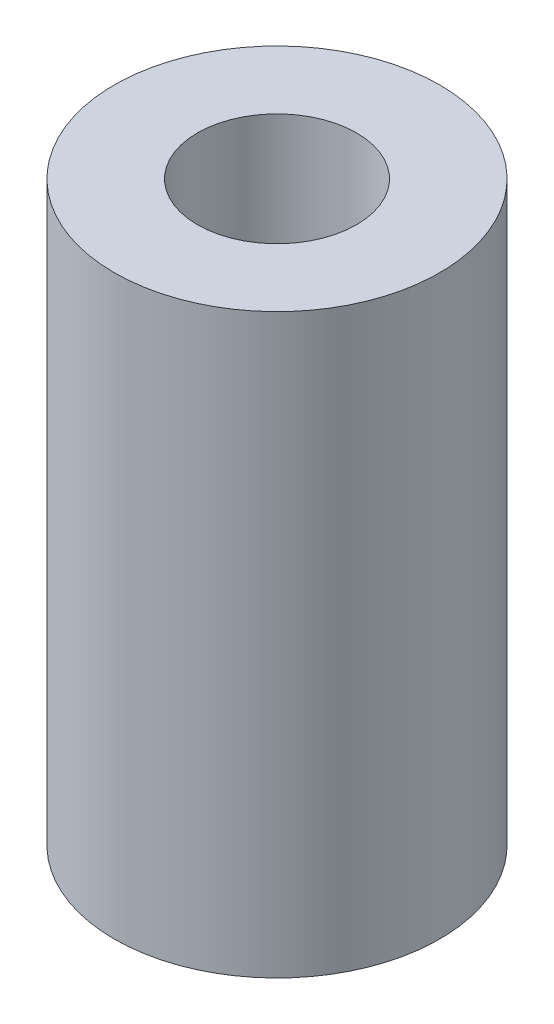
ISO-10303-21;
HEADER;
FILE_DESCRIPTION(('STEP AP214'),'2;1');
FILE_NAME('part.step','',(''),(''),'','','');
FILE_SCHEMA(('AUTOMOTIVE_DESIGN { 1 0 10303 214 1 1 1 1 }'));
ENDSEC;
DATA;
#1=APPLICATION_CONTEXT('core data for automotive mechanical design processes');
#2=APPLICATION_PROTOCOL_DEFINITION('international standard','automotive_design',2000,#1);
#3=PRODUCT_CONTEXT('',#1,'mechanical');
#4=PRODUCT('Part','Part','',(#3));
#5=PRODUCT_RELATED_PRODUCT_CATEGORY('part','',(#4));
#6=PRODUCT_DEFINITION_FORMATION('','',#4);
#7=PRODUCT_DEFINITION_CONTEXT('part definition',#1,'design');
#8=PRODUCT_DEFINITION('design','',#6,#7);
#9=PRODUCT_DEFINITION_SHAPE('','',#8);
#10=(LENGTH_UNIT() NAMED_UNIT(*) SI_UNIT(.MILLI.,.METRE.));
#11=(NAMED_UNIT(*) PLANE_ANGLE_UNIT() SI_UNIT($,.RADIAN.));
#12=(NAMED_UNIT(*) SI_UNIT($,.STERADIAN.) SOLID_ANGLE_UNIT());
#13=UNCERTAINTY_MEASURE_WITH_UNIT(LENGTH_MEASURE(1.E-05),#10,'distance_accuracy_value','');
#14=(GEOMETRIC_REPRESENTATION_CONTEXT(3) GLOBAL_UNCERTAINTY_ASSIGNED_CONTEXT((#13)) GLOBAL_UNIT_ASSIGNED_CONTEXT((#10,
#11,#12)) REPRESENTATION_CONTEXT('',''));
#15=CARTESIAN_POINT('',(0.,0.,0.));
#16=DIRECTION('',(0.,0.,1.));
#17=DIRECTION('',(1.,0.,0.));
#18=AXIS2_PLACEMENT_3D('',#15,#16,#17);
#19=CARTESIAN_POINT('',(0.,115.146666666667,0.));
#20=DIRECTION('',(0.,1.,0.));
#21=DIRECTION('',(0.,0.,1.));
#22=AXIS2_PLACEMENT_3D('',#19,#20,#21);
#23=PLANE('',#22);
#24=CARTESIAN_POINT('',(0.,115.146666666667,0.));
#25=DIRECTION('',(0.,1.,0.));
#26=DIRECTION('',(0.,0.,1.));
#27=AXIS2_PLACEMENT_3D('',#24,#25,#26);
#28=CIRCLE('',#27,32.4612);
#29=CARTESIAN_POINT('',(0.,115.146666666667,32.4612));
#30=VERTEX_POINT('',#29);
#31=EDGE_CURVE('E10',#30,#30,#28,.T.);
#32=ORIENTED_EDGE('',*,*,#31,.T.);
#33=EDGE_LOOP('',(#32));
#34=FACE_BOUND('',#33,.T.);
#35=CARTESIAN_POINT('',(0.,115.146666666667,0.));
#36=DIRECTION('',(0.,1.,0.));
#37=DIRECTION('',(0.,0.,1.));
#38=AXIS2_PLACEMENT_3D('',#35,#36,#37);
#39=CIRCLE('',#38,15.875);
#40=CARTESIAN_POINT('',(0.,115.146666666667,15.875));
#41=VERTEX_POINT('',#40);
#42=EDGE_CURVE('E52',#41,#41,#39,.T.);
#43=ORIENTED_EDGE('',*,*,#42,.F.);
#44=EDGE_LOOP('',(#43));
#45=FACE_BOUND('',#44,.T.);
#46=ADVANCED_FACE('F41',(#34,#45),#23,.T.);
#47=CARTESIAN_POINT('',(0.,0.,0.));
#48=DIRECTION('',(0.,1.,0.));
#49=DIRECTION('',(0.,0.,1.));
#50=AXIS2_PLACEMENT_3D('',#47,#48,#49);
#51=PLANE('',#50);
#52=CARTESIAN_POINT('',(0.,0.,0.));
#53=DIRECTION('',(0.,1.,0.));
#54=DIRECTION('',(0.,0.,1.));
#55=AXIS2_PLACEMENT_3D('',#52,#53,#54);
#56=CIRCLE('',#55,32.4612);
#57=CARTESIAN_POINT('',(0.,0.,32.4612));
#58=VERTEX_POINT('',#57);
#59=EDGE_CURVE('E45',#58,#58,#56,.T.);
#60=ORIENTED_EDGE('',*,*,#59,.F.);
#61=EDGE_LOOP('',(#60));
#62=FACE_BOUND('',#61,.T.);
#63=CARTESIAN_POINT('',(0.,0.,0.));
#64=DIRECTION('',(0.,1.,0.));
#65=DIRECTION('',(0.,0.,1.));
#66=AXIS2_PLACEMENT_3D('',#63,#64,#65);
#67=CIRCLE('',#66,15.875);
#68=CARTESIAN_POINT('',(0.,0.,15.875));
#69=VERTEX_POINT('',#68);
#70=EDGE_CURVE('E54',#69,#69,#67,.T.);
#71=ORIENTED_EDGE('',*,*,#70,.T.);
#72=EDGE_LOOP('',(#71));
#73=FACE_BOUND('',#72,.T.);
#74=ADVANCED_FACE('F64',(#62,#73),#51,.F.);
#75=CARTESIAN_POINT('',(0.,115.146666666667,0.));
#76=DIRECTION('',(0.,-1.,0.));
#77=DIRECTION('',(0.,0.,-1.));
#78=AXIS2_PLACEMENT_3D('',#75,#76,#77);
#79=CYLINDRICAL_SURFACE('',#78,32.4612);
#80=ORIENTED_EDGE('',*,*,#31,.F.);
#81=EDGE_LOOP('',(#80));
#82=FACE_BOUND('',#81,.T.);
#83=ORIENTED_EDGE('',*,*,#59,.T.);
#84=EDGE_LOOP('',(#83));
#85=FACE_BOUND('',#84,.T.);
#86=ADVANCED_FACE('F43',(#82,#85),#79,.T.);
#87=CARTESIAN_POINT('',(0.,115.146666666667,0.));
#88=DIRECTION('',(0.,-1.,0.));
#89=DIRECTION('',(0.,0.,-1.));
#90=AXIS2_PLACEMENT_3D('',#87,#88,#89);
#91=CYLINDRICAL_SURFACE('',#90,15.875);
#92=ORIENTED_EDGE('',*,*,#42,.T.);
#93=EDGE_LOOP('',(#92));
#94=FACE_BOUND('',#93,.T.);
#95=ORIENTED_EDGE('',*,*,#70,.F.);
#96=EDGE_LOOP('',(#95));
#97=FACE_BOUND('',#96,.T.);
#98=ADVANCED_FACE('F60',(#94,#97),#91,.F.);
#99=CLOSED_SHELL('',(#46,#74,#86,#98));
#100=MANIFOLD_SOLID_BREP('B2',#99);
#101=ADVANCED_BREP_SHAPE_REPRESENTATION('',(#18,#100),#14);
#102=SHAPE_DEFINITION_REPRESENTATION(#9,#101);
ENDSEC;
END-ISO-10303-21;
